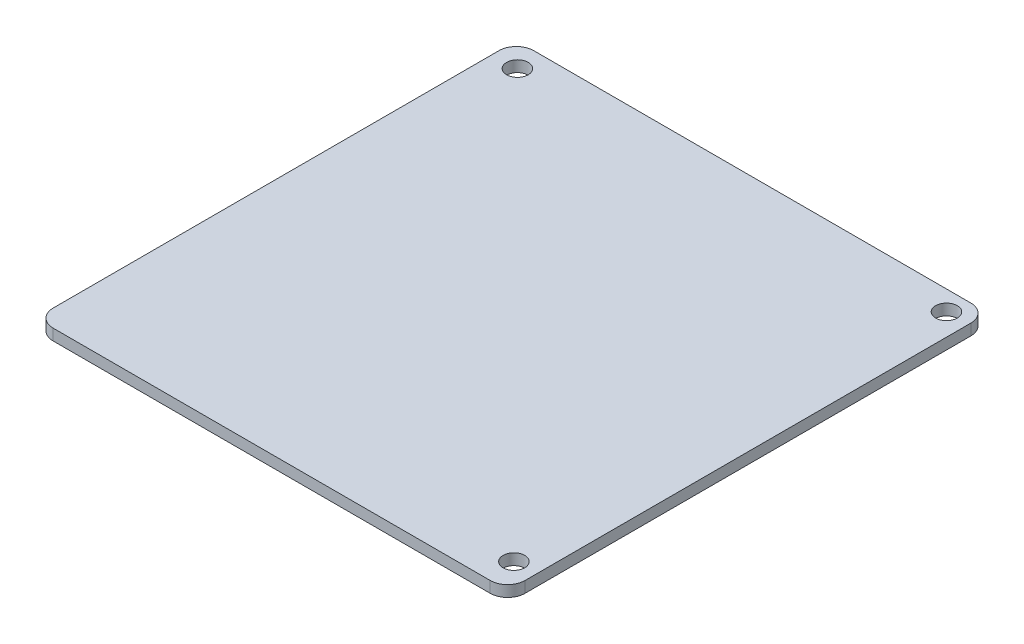
ISO-10303-21;
HEADER;
FILE_DESCRIPTION(('STEP AP214'),'2;1');
FILE_NAME('part.step','',(''),(''),'','','');
FILE_SCHEMA(('AUTOMOTIVE_DESIGN { 1 0 10303 214 1 1 1 1 }'));
ENDSEC;
DATA;
#1=APPLICATION_CONTEXT('core data for automotive mechanical design processes');
#2=APPLICATION_PROTOCOL_DEFINITION('international standard','automotive_design',2000,#1);
#3=PRODUCT_CONTEXT('',#1,'mechanical');
#4=PRODUCT('Part','Part','',(#3));
#5=PRODUCT_RELATED_PRODUCT_CATEGORY('part','',(#4));
#6=PRODUCT_DEFINITION_FORMATION('','',#4);
#7=PRODUCT_DEFINITION_CONTEXT('part definition',#1,'design');
#8=PRODUCT_DEFINITION('design','',#6,#7);
#9=PRODUCT_DEFINITION_SHAPE('','',#8);
#10=(LENGTH_UNIT() NAMED_UNIT(*) SI_UNIT(.MILLI.,.METRE.));
#11=(NAMED_UNIT(*) PLANE_ANGLE_UNIT() SI_UNIT($,.RADIAN.));
#12=(NAMED_UNIT(*) SI_UNIT($,.STERADIAN.) SOLID_ANGLE_UNIT());
#13=UNCERTAINTY_MEASURE_WITH_UNIT(LENGTH_MEASURE(1.E-05),#10,'distance_accuracy_value','');
#14=(GEOMETRIC_REPRESENTATION_CONTEXT(3) GLOBAL_UNCERTAINTY_ASSIGNED_CONTEXT((#13)) GLOBAL_UNIT_ASSIGNED_CONTEXT((#10,
#11,#12)) REPRESENTATION_CONTEXT('',''));
#15=CARTESIAN_POINT('',(0.,0.,0.));
#16=DIRECTION('',(0.,0.,1.));
#17=DIRECTION('',(1.,0.,0.));
#18=AXIS2_PLACEMENT_3D('',#15,#16,#17);
#19=CARTESIAN_POINT('',(33.874,1.6,34.5));
#20=DIRECTION('',(-1.,0.,0.));
#21=DIRECTION('',(0.,0.,1.));
#22=AXIS2_PLACEMENT_3D('',#19,#20,#21);
#23=PLANE('',#22);
#24=DIRECTION('',(0.,0.,-1.));
#25=VECTOR('',#24,1.);
#26=CARTESIAN_POINT('',(33.874,1.6,34.5));
#27=LINE('',#26,#25);
#28=CARTESIAN_POINT('',(33.874,1.6,32.));
#29=VERTEX_POINT('',#28);
#30=CARTESIAN_POINT('',(33.874,1.6,-32.));
#31=VERTEX_POINT('',#30);
#32=EDGE_CURVE('E141',#29,#31,#27,.T.);
#33=ORIENTED_EDGE('',*,*,#32,.F.);
#34=DIRECTION('',(0.,-1.,0.));
#35=VECTOR('',#34,1.);
#36=CARTESIAN_POINT('',(33.874,1.6,32.));
#37=LINE('',#36,#35);
#38=CARTESIAN_POINT('',(33.874,0.,32.));
#39=VERTEX_POINT('',#38);
#40=EDGE_CURVE('E196',#29,#39,#37,.T.);
#41=ORIENTED_EDGE('',*,*,#40,.T.);
#42=DIRECTION('',(0.,0.,-1.));
#43=VECTOR('',#42,1.);
#44=CARTESIAN_POINT('',(33.874,0.,34.5));
#45=LINE('',#44,#43);
#46=CARTESIAN_POINT('',(33.874,0.,-32.));
#47=VERTEX_POINT('',#46);
#48=EDGE_CURVE('E156',#39,#47,#45,.T.);
#49=ORIENTED_EDGE('',*,*,#48,.T.);
#50=DIRECTION('',(0.,-1.,0.));
#51=VECTOR('',#50,1.);
#52=CARTESIAN_POINT('',(33.874,1.6,-32.));
#53=LINE('',#52,#51);
#54=EDGE_CURVE('E193',#47,#31,#53,.F.);
#55=ORIENTED_EDGE('',*,*,#54,.T.);
#56=EDGE_LOOP('',(#33,#41,#49,#55));
#57=FACE_BOUND('',#56,.T.);
#58=ADVANCED_FACE('F45',(#57),#23,.F.);
#59=CARTESIAN_POINT('',(-33.874,1.6,-34.5));
#60=DIRECTION('',(0.,0.,1.));
#61=DIRECTION('',(1.,0.,0.));
#62=AXIS2_PLACEMENT_3D('',#59,#60,#61);
#63=PLANE('',#62);
#64=DIRECTION('',(-1.,0.,0.));
#65=VECTOR('',#64,1.);
#66=CARTESIAN_POINT('',(-33.874,1.6,-34.5));
#67=LINE('',#66,#65);
#68=CARTESIAN_POINT('',(31.374,1.6,-34.5));
#69=VERTEX_POINT('',#68);
#70=CARTESIAN_POINT('',(-31.374,1.6,-34.5));
#71=VERTEX_POINT('',#70);
#72=EDGE_CURVE('E146',#69,#71,#67,.T.);
#73=ORIENTED_EDGE('',*,*,#72,.F.);
#74=DIRECTION('',(0.,-1.,0.));
#75=VECTOR('',#74,1.);
#76=CARTESIAN_POINT('',(31.374,1.6,-34.5));
#77=LINE('',#76,#75);
#78=CARTESIAN_POINT('',(31.374,0.,-34.5));
#79=VERTEX_POINT('',#78);
#80=EDGE_CURVE('E11',#69,#79,#77,.T.);
#81=ORIENTED_EDGE('',*,*,#80,.T.);
#82=DIRECTION('',(-1.,0.,0.));
#83=VECTOR('',#82,1.);
#84=CARTESIAN_POINT('',(-33.874,0.,-34.5));
#85=LINE('',#84,#83);
#86=CARTESIAN_POINT('',(-31.374,0.,-34.5));
#87=VERTEX_POINT('',#86);
#88=EDGE_CURVE('E148',#79,#87,#85,.T.);
#89=ORIENTED_EDGE('',*,*,#88,.T.);
#90=DIRECTION('',(0.,-1.,0.));
#91=VECTOR('',#90,1.);
#92=CARTESIAN_POINT('',(-31.374,1.6,-34.5));
#93=LINE('',#92,#91);
#94=EDGE_CURVE('E54',#87,#71,#93,.F.);
#95=ORIENTED_EDGE('',*,*,#94,.T.);
#96=EDGE_LOOP('',(#73,#81,#89,#95));
#97=FACE_BOUND('',#96,.T.);
#98=ADVANCED_FACE('F215',(#97),#63,.F.);
#99=CARTESIAN_POINT('',(-33.874,1.6,34.5));
#100=DIRECTION('',(1.,0.,0.));
#101=DIRECTION('',(0.,0.,-1.));
#102=AXIS2_PLACEMENT_3D('',#99,#100,#101);
#103=PLANE('',#102);
#104=DIRECTION('',(0.,0.,1.));
#105=VECTOR('',#104,1.);
#106=CARTESIAN_POINT('',(-33.874,0.,34.5));
#107=LINE('',#106,#105);
#108=CARTESIAN_POINT('',(-33.874,0.,-32.));
#109=VERTEX_POINT('',#108);
#110=CARTESIAN_POINT('',(-33.874,0.,32.));
#111=VERTEX_POINT('',#110);
#112=EDGE_CURVE('E142',#109,#111,#107,.T.);
#113=ORIENTED_EDGE('',*,*,#112,.T.);
#114=DIRECTION('',(0.,-1.,0.));
#115=VECTOR('',#114,1.);
#116=CARTESIAN_POINT('',(-33.874,1.6,32.));
#117=LINE('',#116,#115);
#118=CARTESIAN_POINT('',(-33.874,1.6,32.));
#119=VERTEX_POINT('',#118);
#120=EDGE_CURVE('E117',#111,#119,#117,.F.);
#121=ORIENTED_EDGE('',*,*,#120,.T.);
#122=DIRECTION('',(0.,0.,1.));
#123=VECTOR('',#122,1.);
#124=CARTESIAN_POINT('',(-33.874,1.6,34.5));
#125=LINE('',#124,#123);
#126=CARTESIAN_POINT('',(-33.874,1.6,-32.));
#127=VERTEX_POINT('',#126);
#128=EDGE_CURVE('E202',#127,#119,#125,.T.);
#129=ORIENTED_EDGE('',*,*,#128,.F.);
#130=DIRECTION('',(0.,-1.,0.));
#131=VECTOR('',#130,1.);
#132=CARTESIAN_POINT('',(-33.874,1.6,-32.));
#133=LINE('',#132,#131);
#134=EDGE_CURVE('E123',#127,#109,#133,.T.);
#135=ORIENTED_EDGE('',*,*,#134,.T.);
#136=EDGE_LOOP('',(#113,#121,#129,#135));
#137=FACE_BOUND('',#136,.T.);
#138=ADVANCED_FACE('F222',(#137),#103,.F.);
#139=CARTESIAN_POINT('',(-33.874,1.6,34.5));
#140=DIRECTION('',(0.,0.,-1.));
#141=DIRECTION('',(-1.,0.,0.));
#142=AXIS2_PLACEMENT_3D('',#139,#140,#141);
#143=PLANE('',#142);
#144=DIRECTION('',(1.,0.,0.));
#145=VECTOR('',#144,1.);
#146=CARTESIAN_POINT('',(-33.874,1.6,34.5));
#147=LINE('',#146,#145);
#148=CARTESIAN_POINT('',(-31.374,1.6,34.5));
#149=VERTEX_POINT('',#148);
#150=CARTESIAN_POINT('',(31.374,1.6,34.5));
#151=VERTEX_POINT('',#150);
#152=EDGE_CURVE('E133',#149,#151,#147,.T.);
#153=ORIENTED_EDGE('',*,*,#152,.F.);
#154=DIRECTION('',(0.,-1.,0.));
#155=VECTOR('',#154,1.);
#156=CARTESIAN_POINT('',(-31.374,1.6,34.5));
#157=LINE('',#156,#155);
#158=CARTESIAN_POINT('',(-31.374,0.,34.5));
#159=VERTEX_POINT('',#158);
#160=EDGE_CURVE('E116',#149,#159,#157,.T.);
#161=ORIENTED_EDGE('',*,*,#160,.T.);
#162=DIRECTION('',(1.,0.,0.));
#163=VECTOR('',#162,1.);
#164=CARTESIAN_POINT('',(-33.874,0.,34.5));
#165=LINE('',#164,#163);
#166=CARTESIAN_POINT('',(31.374,0.,34.5));
#167=VERTEX_POINT('',#166);
#168=EDGE_CURVE('E130',#159,#167,#165,.T.);
#169=ORIENTED_EDGE('',*,*,#168,.T.);
#170=DIRECTION('',(0.,-1.,0.));
#171=VECTOR('',#170,1.);
#172=CARTESIAN_POINT('',(31.374,1.6,34.5));
#173=LINE('',#172,#171);
#174=EDGE_CURVE('E136',#167,#151,#173,.F.);
#175=ORIENTED_EDGE('',*,*,#174,.T.);
#176=EDGE_LOOP('',(#153,#161,#169,#175));
#177=FACE_BOUND('',#176,.T.);
#178=ADVANCED_FACE('F129',(#177),#143,.F.);
#179=CARTESIAN_POINT('',(0.,1.6,0.));
#180=DIRECTION('',(0.,-1.,0.));
#181=DIRECTION('',(0.,0.,-1.));
#182=AXIS2_PLACEMENT_3D('',#179,#180,#181);
#183=PLANE('',#182);
#184=CARTESIAN_POINT('',(-30.323,1.6,-31.1));
#185=DIRECTION('',(0.,1.,0.));
#186=DIRECTION('',(0.,0.,1.));
#187=AXIS2_PLACEMENT_3D('',#184,#185,#186);
#188=CIRCLE('',#187,1.54999999999999);
#189=CARTESIAN_POINT('',(-30.323,1.6,-29.55));
#190=VERTEX_POINT('',#189);
#191=EDGE_CURVE('E167',#190,#190,#188,.T.);
#192=ORIENTED_EDGE('',*,*,#191,.F.);
#193=EDGE_LOOP('',(#192));
#194=FACE_BOUND('',#193,.T.);
#195=CARTESIAN_POINT('',(30.727,1.6,-31.65));
#196=DIRECTION('',(0.,1.,0.));
#197=DIRECTION('',(0.,0.,1.));
#198=AXIS2_PLACEMENT_3D('',#195,#196,#197);
#199=CIRCLE('',#198,1.54999999999999);
#200=CARTESIAN_POINT('',(30.727,1.6,-30.1));
#201=VERTEX_POINT('',#200);
#202=EDGE_CURVE('E162',#201,#201,#199,.T.);
#203=ORIENTED_EDGE('',*,*,#202,.F.);
#204=EDGE_LOOP('',(#203));
#205=FACE_BOUND('',#204,.T.);
#206=CARTESIAN_POINT('',(30.724,1.6,30.453));
#207=DIRECTION('',(0.,1.,0.));
#208=DIRECTION('',(0.,0.,1.));
#209=AXIS2_PLACEMENT_3D('',#206,#207,#208);
#210=CIRCLE('',#209,1.55);
#211=CARTESIAN_POINT('',(30.724,1.6,32.003));
#212=VERTEX_POINT('',#211);
#213=EDGE_CURVE('E157',#212,#212,#210,.T.);
#214=ORIENTED_EDGE('',*,*,#213,.F.);
#215=EDGE_LOOP('',(#214));
#216=FACE_BOUND('',#215,.T.);
#217=ORIENTED_EDGE('',*,*,#128,.T.);
#218=CARTESIAN_POINT('',(-31.374,1.6,32.));
#219=DIRECTION('',(0.,-1.,0.));
#220=DIRECTION('',(0.,0.,-1.));
#221=AXIS2_PLACEMENT_3D('',#218,#219,#220);
#222=CIRCLE('',#221,2.5);
#223=EDGE_CURVE('E190',#119,#149,#222,.F.);
#224=ORIENTED_EDGE('',*,*,#223,.T.);
#225=ORIENTED_EDGE('',*,*,#152,.T.);
#226=CARTESIAN_POINT('',(31.374,1.6,32.));
#227=DIRECTION('',(0.,-1.,0.));
#228=DIRECTION('',(0.,0.,-1.));
#229=AXIS2_PLACEMENT_3D('',#226,#227,#228);
#230=CIRCLE('',#229,2.5);
#231=EDGE_CURVE('E187',#151,#29,#230,.F.);
#232=ORIENTED_EDGE('',*,*,#231,.T.);
#233=ORIENTED_EDGE('',*,*,#32,.T.);
#234=CARTESIAN_POINT('',(31.374,1.6,-32.));
#235=DIRECTION('',(0.,-1.,0.));
#236=DIRECTION('',(0.,0.,-1.));
#237=AXIS2_PLACEMENT_3D('',#234,#235,#236);
#238=CIRCLE('',#237,2.5);
#239=EDGE_CURVE('E67',#31,#69,#238,.F.);
#240=ORIENTED_EDGE('',*,*,#239,.T.);
#241=ORIENTED_EDGE('',*,*,#72,.T.);
#242=CARTESIAN_POINT('',(-31.374,1.6,-32.));
#243=DIRECTION('',(0.,-1.,0.));
#244=DIRECTION('',(0.,0.,-1.));
#245=AXIS2_PLACEMENT_3D('',#242,#243,#244);
#246=CIRCLE('',#245,2.5);
#247=EDGE_CURVE('E182',#71,#127,#246,.F.);
#248=ORIENTED_EDGE('',*,*,#247,.T.);
#249=EDGE_LOOP('',(#217,#224,#225,#232,#233,#240,#241,#248));
#250=FACE_BOUND('',#249,.T.);
#251=ADVANCED_FACE('F220',(#194,#205,#216,#250),#183,.F.);
#252=CARTESIAN_POINT('',(0.,0.,0.));
#253=DIRECTION('',(0.,-1.,0.));
#254=DIRECTION('',(0.,0.,-1.));
#255=AXIS2_PLACEMENT_3D('',#252,#253,#254);
#256=PLANE('',#255);
#257=CARTESIAN_POINT('',(-30.323,0.,-31.1));
#258=DIRECTION('',(0.,-1.,0.));
#259=DIRECTION('',(0.,0.,-1.));
#260=AXIS2_PLACEMENT_3D('',#257,#258,#259);
#261=CIRCLE('',#260,1.54999999999999);
#262=CARTESIAN_POINT('',(-30.323,0.,-32.65));
#263=VERTEX_POINT('',#262);
#264=EDGE_CURVE('E163',#263,#263,#261,.T.);
#265=ORIENTED_EDGE('',*,*,#264,.F.);
#266=EDGE_LOOP('',(#265));
#267=FACE_BOUND('',#266,.T.);
#268=CARTESIAN_POINT('',(30.727,0.,-31.65));
#269=DIRECTION('',(0.,-1.,0.));
#270=DIRECTION('',(0.,0.,-1.));
#271=AXIS2_PLACEMENT_3D('',#268,#269,#270);
#272=CIRCLE('',#271,1.54999999999999);
#273=CARTESIAN_POINT('',(30.727,0.,-33.2));
#274=VERTEX_POINT('',#273);
#275=EDGE_CURVE('E158',#274,#274,#272,.T.);
#276=ORIENTED_EDGE('',*,*,#275,.F.);
#277=EDGE_LOOP('',(#276));
#278=FACE_BOUND('',#277,.T.);
#279=CARTESIAN_POINT('',(30.724,0.,30.453));
#280=DIRECTION('',(0.,-1.,0.));
#281=DIRECTION('',(0.,0.,-1.));
#282=AXIS2_PLACEMENT_3D('',#279,#280,#281);
#283=CIRCLE('',#282,1.54999999999999);
#284=CARTESIAN_POINT('',(30.724,0.,28.903));
#285=VERTEX_POINT('',#284);
#286=EDGE_CURVE('E152',#285,#285,#283,.T.);
#287=ORIENTED_EDGE('',*,*,#286,.F.);
#288=EDGE_LOOP('',(#287));
#289=FACE_BOUND('',#288,.T.);
#290=ORIENTED_EDGE('',*,*,#168,.F.);
#291=CARTESIAN_POINT('',(-31.374,0.,32.));
#292=DIRECTION('',(0.,-1.,0.));
#293=DIRECTION('',(0.,0.,-1.));
#294=AXIS2_PLACEMENT_3D('',#291,#292,#293);
#295=CIRCLE('',#294,2.5);
#296=EDGE_CURVE('E112',#159,#111,#295,.T.);
#297=ORIENTED_EDGE('',*,*,#296,.T.);
#298=ORIENTED_EDGE('',*,*,#112,.F.);
#299=CARTESIAN_POINT('',(-31.374,0.,-32.));
#300=DIRECTION('',(0.,-1.,0.));
#301=DIRECTION('',(0.,0.,-1.));
#302=AXIS2_PLACEMENT_3D('',#299,#300,#301);
#303=CIRCLE('',#302,2.5);
#304=EDGE_CURVE('E135',#109,#87,#303,.T.);
#305=ORIENTED_EDGE('',*,*,#304,.T.);
#306=ORIENTED_EDGE('',*,*,#88,.F.);
#307=CARTESIAN_POINT('',(31.374,0.,-32.));
#308=DIRECTION('',(0.,-1.,0.));
#309=DIRECTION('',(0.,0.,-1.));
#310=AXIS2_PLACEMENT_3D('',#307,#308,#309);
#311=CIRCLE('',#310,2.5);
#312=EDGE_CURVE('E172',#79,#47,#311,.T.);
#313=ORIENTED_EDGE('',*,*,#312,.T.);
#314=ORIENTED_EDGE('',*,*,#48,.F.);
#315=CARTESIAN_POINT('',(31.374,0.,32.));
#316=DIRECTION('',(0.,-1.,0.));
#317=DIRECTION('',(0.,0.,-1.));
#318=AXIS2_PLACEMENT_3D('',#315,#316,#317);
#319=CIRCLE('',#318,2.5);
#320=EDGE_CURVE('E124',#39,#167,#319,.T.);
#321=ORIENTED_EDGE('',*,*,#320,.T.);
#322=EDGE_LOOP('',(#290,#297,#298,#305,#306,#313,#314,#321));
#323=FACE_BOUND('',#322,.T.);
#324=ADVANCED_FACE('F138',(#267,#278,#289,#323),#256,.T.);
#325=CARTESIAN_POINT('',(30.724,1.6,30.453));
#326=DIRECTION('',(0.,1.,0.));
#327=DIRECTION('',(0.,0.,1.));
#328=AXIS2_PLACEMENT_3D('',#325,#326,#327);
#329=CYLINDRICAL_SURFACE('',#328,1.54999999999999);
#330=ORIENTED_EDGE('',*,*,#286,.T.);
#331=EDGE_LOOP('',(#330));
#332=FACE_BOUND('',#331,.T.);
#333=ORIENTED_EDGE('',*,*,#213,.T.);
#334=EDGE_LOOP('',(#333));
#335=FACE_BOUND('',#334,.T.);
#336=ADVANCED_FACE('F292',(#332,#335),#329,.F.);
#337=CARTESIAN_POINT('',(30.727,1.6,-31.65));
#338=DIRECTION('',(0.,1.,0.));
#339=DIRECTION('',(0.,0.,1.));
#340=AXIS2_PLACEMENT_3D('',#337,#338,#339);
#341=CYLINDRICAL_SURFACE('',#340,1.54999999999999);
#342=ORIENTED_EDGE('',*,*,#275,.T.);
#343=EDGE_LOOP('',(#342));
#344=FACE_BOUND('',#343,.T.);
#345=ORIENTED_EDGE('',*,*,#202,.T.);
#346=EDGE_LOOP('',(#345));
#347=FACE_BOUND('',#346,.T.);
#348=ADVANCED_FACE('F282',(#344,#347),#341,.F.);
#349=CARTESIAN_POINT('',(-30.323,1.6,-31.1));
#350=DIRECTION('',(0.,1.,0.));
#351=DIRECTION('',(0.,0.,1.));
#352=AXIS2_PLACEMENT_3D('',#349,#350,#351);
#353=CYLINDRICAL_SURFACE('',#352,1.54999999999999);
#354=ORIENTED_EDGE('',*,*,#264,.T.);
#355=EDGE_LOOP('',(#354));
#356=FACE_BOUND('',#355,.T.);
#357=ORIENTED_EDGE('',*,*,#191,.T.);
#358=EDGE_LOOP('',(#357));
#359=FACE_BOUND('',#358,.T.);
#360=ADVANCED_FACE('F242',(#356,#359),#353,.F.);
#361=CARTESIAN_POINT('',(-31.374,1.6,32.));
#362=DIRECTION('',(0.,-1.,0.));
#363=DIRECTION('',(0.,0.,-1.));
#364=AXIS2_PLACEMENT_3D('',#361,#362,#363);
#365=CYLINDRICAL_SURFACE('',#364,2.5);
#366=ORIENTED_EDGE('',*,*,#223,.F.);
#367=ORIENTED_EDGE('',*,*,#120,.F.);
#368=ORIENTED_EDGE('',*,*,#296,.F.);
#369=ORIENTED_EDGE('',*,*,#160,.F.);
#370=EDGE_LOOP('',(#366,#367,#368,#369));
#371=FACE_BOUND('',#370,.T.);
#372=ADVANCED_FACE('F115',(#371),#365,.T.);
#373=CARTESIAN_POINT('',(31.374,1.6,32.));
#374=DIRECTION('',(0.,-1.,0.));
#375=DIRECTION('',(0.,0.,-1.));
#376=AXIS2_PLACEMENT_3D('',#373,#374,#375);
#377=CYLINDRICAL_SURFACE('',#376,2.5);
#378=ORIENTED_EDGE('',*,*,#231,.F.);
#379=ORIENTED_EDGE('',*,*,#174,.F.);
#380=ORIENTED_EDGE('',*,*,#320,.F.);
#381=ORIENTED_EDGE('',*,*,#40,.F.);
#382=EDGE_LOOP('',(#378,#379,#380,#381));
#383=FACE_BOUND('',#382,.T.);
#384=ADVANCED_FACE('F241',(#383),#377,.T.);
#385=CARTESIAN_POINT('',(31.374,1.6,-32.));
#386=DIRECTION('',(0.,-1.,0.));
#387=DIRECTION('',(0.,0.,-1.));
#388=AXIS2_PLACEMENT_3D('',#385,#386,#387);
#389=CYLINDRICAL_SURFACE('',#388,2.5);
#390=ORIENTED_EDGE('',*,*,#239,.F.);
#391=ORIENTED_EDGE('',*,*,#54,.F.);
#392=ORIENTED_EDGE('',*,*,#312,.F.);
#393=ORIENTED_EDGE('',*,*,#80,.F.);
#394=EDGE_LOOP('',(#390,#391,#392,#393));
#395=FACE_BOUND('',#394,.T.);
#396=ADVANCED_FACE('F244',(#395),#389,.T.);
#397=CARTESIAN_POINT('',(-31.374,1.6,-32.));
#398=DIRECTION('',(0.,-1.,0.));
#399=DIRECTION('',(0.,0.,-1.));
#400=AXIS2_PLACEMENT_3D('',#397,#398,#399);
#401=CYLINDRICAL_SURFACE('',#400,2.5);
#402=ORIENTED_EDGE('',*,*,#247,.F.);
#403=ORIENTED_EDGE('',*,*,#94,.F.);
#404=ORIENTED_EDGE('',*,*,#304,.F.);
#405=ORIENTED_EDGE('',*,*,#134,.F.);
#406=EDGE_LOOP('',(#402,#403,#404,#405));
#407=FACE_BOUND('',#406,.T.);
#408=ADVANCED_FACE('F47',(#407),#401,.T.);
#409=CLOSED_SHELL('',(#58,#98,#138,#178,#251,#324,#336,#348,#360,#372,#384,#396,#408));
#410=MANIFOLD_SOLID_BREP('B2',#409);
#411=ADVANCED_BREP_SHAPE_REPRESENTATION('',(#18,#410),#14);
#412=SHAPE_DEFINITION_REPRESENTATION(#9,#411);
ENDSEC;
END-ISO-10303-21;
